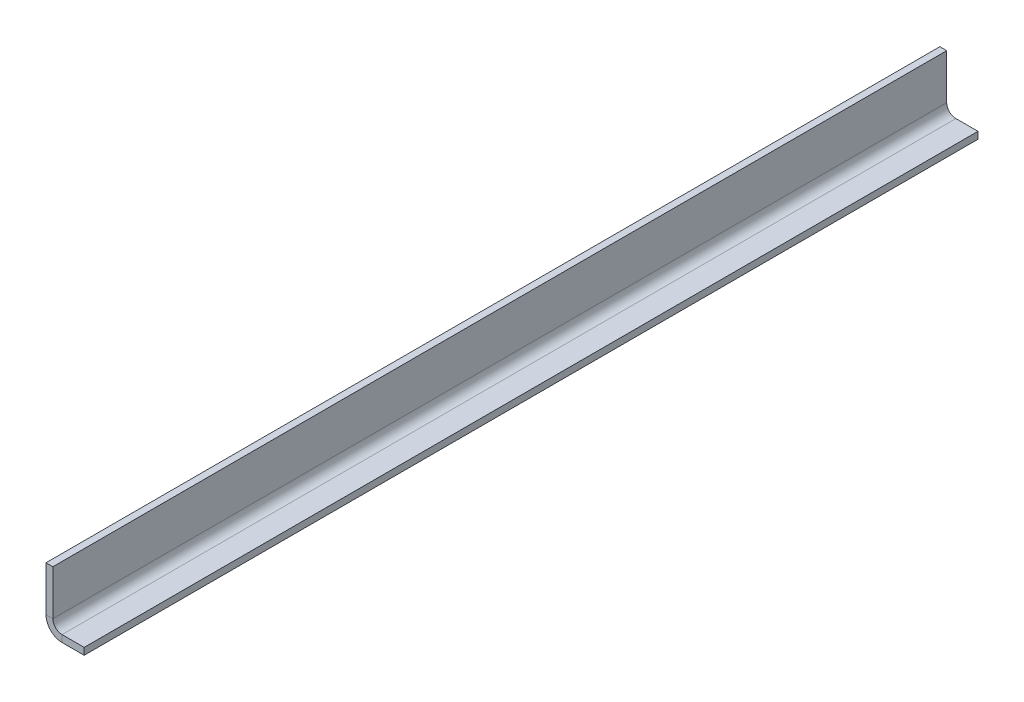
ISO-10303-21;
HEADER;
FILE_DESCRIPTION(('STEP AP214'),'2;1');
FILE_NAME('part.step','',(''),(''),'','','');
FILE_SCHEMA(('AUTOMOTIVE_DESIGN { 1 0 10303 214 1 1 1 1 }'));
ENDSEC;
DATA;
#1=APPLICATION_CONTEXT('core data for automotive mechanical design processes');
#2=APPLICATION_PROTOCOL_DEFINITION('international standard','automotive_design',2000,#1);
#3=PRODUCT_CONTEXT('',#1,'mechanical');
#4=PRODUCT('Part','Part','',(#3));
#5=PRODUCT_RELATED_PRODUCT_CATEGORY('part','',(#4));
#6=PRODUCT_DEFINITION_FORMATION('','',#4);
#7=PRODUCT_DEFINITION_CONTEXT('part definition',#1,'design');
#8=PRODUCT_DEFINITION('design','',#6,#7);
#9=PRODUCT_DEFINITION_SHAPE('','',#8);
#10=(LENGTH_UNIT() NAMED_UNIT(*) SI_UNIT(.MILLI.,.METRE.));
#11=(NAMED_UNIT(*) PLANE_ANGLE_UNIT() SI_UNIT($,.RADIAN.));
#12=(NAMED_UNIT(*) SI_UNIT($,.STERADIAN.) SOLID_ANGLE_UNIT());
#13=UNCERTAINTY_MEASURE_WITH_UNIT(LENGTH_MEASURE(1.E-05),#10,'distance_accuracy_value','');
#14=(GEOMETRIC_REPRESENTATION_CONTEXT(3) GLOBAL_UNCERTAINTY_ASSIGNED_CONTEXT((#13)) GLOBAL_UNIT_ASSIGNED_CONTEXT((#10,
#11,#12)) REPRESENTATION_CONTEXT('',''));
#15=CARTESIAN_POINT('',(0.,0.,0.));
#16=DIRECTION('',(0.,0.,1.));
#17=DIRECTION('',(1.,0.,0.));
#18=AXIS2_PLACEMENT_3D('',#15,#16,#17);
#19=CARTESIAN_POINT('',(3.175,3.175,0.));
#20=DIRECTION('',(0.,0.,1.));
#21=DIRECTION('',(0.,1.,0.));
#22=AXIS2_PLACEMENT_3D('',#19,#20,#21);
#23=PLANE('',#22);
#24=DIRECTION('',(1.,0.,0.));
#25=VECTOR('',#24,1.);
#26=CARTESIAN_POINT('',(3.175,5.175,0.));
#27=LINE('',#26,#25);
#28=CARTESIAN_POINT('',(1.675,5.175,0.));
#29=VERTEX_POINT('',#28);
#30=CARTESIAN_POINT('',(3.175,5.175,0.));
#31=VERTEX_POINT('',#30);
#32=EDGE_CURVE('E11',#29,#31,#27,.T.);
#33=ORIENTED_EDGE('',*,*,#32,.F.);
#34=DIRECTION('',(0.,1.,0.));
#35=VECTOR('',#34,1.);
#36=CARTESIAN_POINT('',(1.675,3.175,0.));
#37=LINE('',#36,#35);
#38=CARTESIAN_POINT('',(1.675,15.,0.));
#39=VERTEX_POINT('',#38);
#40=EDGE_CURVE('E95',#29,#39,#37,.T.);
#41=ORIENTED_EDGE('',*,*,#40,.T.);
#42=DIRECTION('',(1.,0.,0.));
#43=VECTOR('',#42,1.);
#44=CARTESIAN_POINT('',(3.175,15.,0.));
#45=LINE('',#44,#43);
#46=CARTESIAN_POINT('',(3.175,15.,0.));
#47=VERTEX_POINT('',#46);
#48=EDGE_CURVE('E55',#39,#47,#45,.T.);
#49=ORIENTED_EDGE('',*,*,#48,.T.);
#50=DIRECTION('',(0.,1.,0.));
#51=VECTOR('',#50,1.);
#52=CARTESIAN_POINT('',(3.175,3.175,0.));
#53=LINE('',#52,#51);
#54=EDGE_CURVE('E98',#31,#47,#53,.T.);
#55=ORIENTED_EDGE('',*,*,#54,.F.);
#56=EDGE_LOOP('',(#33,#41,#49,#55));
#57=FACE_BOUND('',#56,.T.);
#58=ADVANCED_FACE('F45',(#57),#23,.F.);
#59=CARTESIAN_POINT('',(3.175,15.,195.));
#60=DIRECTION('',(0.,1.,0.));
#61=DIRECTION('',(0.,0.,-1.));
#62=AXIS2_PLACEMENT_3D('',#59,#60,#61);
#63=PLANE('',#62);
#64=ORIENTED_EDGE('',*,*,#48,.F.);
#65=DIRECTION('',(0.,0.,1.));
#66=VECTOR('',#65,1.);
#67=CARTESIAN_POINT('',(1.675,15.,195.));
#68=LINE('',#67,#66);
#69=CARTESIAN_POINT('',(1.675,15.,195.));
#70=VERTEX_POINT('',#69);
#71=EDGE_CURVE('E123',#70,#39,#68,.F.);
#72=ORIENTED_EDGE('',*,*,#71,.F.);
#73=DIRECTION('',(1.,0.,0.));
#74=VECTOR('',#73,1.);
#75=CARTESIAN_POINT('',(3.175,15.,195.));
#76=LINE('',#75,#74);
#77=CARTESIAN_POINT('',(3.175,15.,195.));
#78=VERTEX_POINT('',#77);
#79=EDGE_CURVE('E141',#70,#78,#76,.T.);
#80=ORIENTED_EDGE('',*,*,#79,.T.);
#81=DIRECTION('',(0.,0.,-1.));
#82=VECTOR('',#81,1.);
#83=CARTESIAN_POINT('',(3.175,15.,195.));
#84=LINE('',#83,#82);
#85=EDGE_CURVE('E152',#78,#47,#84,.T.);
#86=ORIENTED_EDGE('',*,*,#85,.T.);
#87=EDGE_LOOP('',(#64,#72,#80,#86));
#88=FACE_BOUND('',#87,.T.);
#89=ADVANCED_FACE('F158',(#88),#63,.T.);
#90=CARTESIAN_POINT('',(3.175,3.175,195.));
#91=DIRECTION('',(0.,0.,1.));
#92=DIRECTION('',(0.,1.,0.));
#93=AXIS2_PLACEMENT_3D('',#90,#91,#92);
#94=PLANE('',#93);
#95=ORIENTED_EDGE('',*,*,#79,.F.);
#96=DIRECTION('',(0.,1.,0.));
#97=VECTOR('',#96,1.);
#98=CARTESIAN_POINT('',(1.675,3.175,195.));
#99=LINE('',#98,#97);
#100=CARTESIAN_POINT('',(1.675,5.175,195.));
#101=VERTEX_POINT('',#100);
#102=EDGE_CURVE('E183',#101,#70,#99,.T.);
#103=ORIENTED_EDGE('',*,*,#102,.F.);
#104=DIRECTION('',(1.,0.,0.));
#105=VECTOR('',#104,1.);
#106=CARTESIAN_POINT('',(3.175,5.175,195.));
#107=LINE('',#106,#105);
#108=CARTESIAN_POINT('',(3.175,5.175,195.));
#109=VERTEX_POINT('',#108);
#110=EDGE_CURVE('E138',#101,#109,#107,.T.);
#111=ORIENTED_EDGE('',*,*,#110,.T.);
#112=DIRECTION('',(0.,1.,0.));
#113=VECTOR('',#112,1.);
#114=CARTESIAN_POINT('',(3.175,3.175,195.));
#115=LINE('',#114,#113);
#116=EDGE_CURVE('E159',#109,#78,#115,.T.);
#117=ORIENTED_EDGE('',*,*,#116,.T.);
#118=EDGE_LOOP('',(#95,#103,#111,#117));
#119=FACE_BOUND('',#118,.T.);
#120=ADVANCED_FACE('F189',(#119),#94,.T.);
#121=CARTESIAN_POINT('',(5.175,5.175,195.));
#122=DIRECTION('',(0.,0.,1.));
#123=DIRECTION('',(1.,0.,0.));
#124=AXIS2_PLACEMENT_3D('',#121,#122,#123);
#125=PLANE('',#124);
#126=ORIENTED_EDGE('',*,*,#110,.F.);
#127=CARTESIAN_POINT('',(5.175,5.175,195.));
#128=DIRECTION('',(0.,0.,1.));
#129=DIRECTION('',(1.,0.,0.));
#130=AXIS2_PLACEMENT_3D('',#127,#128,#129);
#131=CIRCLE('',#130,3.5);
#132=CARTESIAN_POINT('',(5.175,1.675,195.));
#133=VERTEX_POINT('',#132);
#134=EDGE_CURVE('E113',#101,#133,#131,.T.);
#135=ORIENTED_EDGE('',*,*,#134,.T.);
#136=DIRECTION('',(0.,1.,0.));
#137=VECTOR('',#136,1.);
#138=CARTESIAN_POINT('',(5.175,3.175,195.));
#139=LINE('',#138,#137);
#140=CARTESIAN_POINT('',(5.175,3.175,195.));
#141=VERTEX_POINT('',#140);
#142=EDGE_CURVE('E63',#133,#141,#139,.T.);
#143=ORIENTED_EDGE('',*,*,#142,.T.);
#144=CARTESIAN_POINT('',(5.175,5.175,195.));
#145=DIRECTION('',(0.,0.,-1.));
#146=DIRECTION('',(-1.,0.,0.));
#147=AXIS2_PLACEMENT_3D('',#144,#145,#146);
#148=CIRCLE('',#147,2.);
#149=EDGE_CURVE('E156',#109,#141,#148,.F.);
#150=ORIENTED_EDGE('',*,*,#149,.F.);
#151=EDGE_LOOP('',(#126,#135,#143,#150));
#152=FACE_BOUND('',#151,.T.);
#153=ADVANCED_FACE('F192',(#152),#125,.T.);
#154=CARTESIAN_POINT('',(10.,3.175,195.));
#155=DIRECTION('',(0.,0.,1.));
#156=DIRECTION('',(-1.,0.,0.));
#157=AXIS2_PLACEMENT_3D('',#154,#155,#156);
#158=PLANE('',#157);
#159=ORIENTED_EDGE('',*,*,#142,.F.);
#160=DIRECTION('',(1.,0.,0.));
#161=VECTOR('',#160,1.);
#162=CARTESIAN_POINT('',(10.,1.675,195.));
#163=LINE('',#162,#161);
#164=CARTESIAN_POINT('',(10.,1.675,195.));
#165=VERTEX_POINT('',#164);
#166=EDGE_CURVE('E182',#165,#133,#163,.F.);
#167=ORIENTED_EDGE('',*,*,#166,.F.);
#168=DIRECTION('',(0.,1.,0.));
#169=VECTOR('',#168,1.);
#170=CARTESIAN_POINT('',(10.,3.175,195.));
#171=LINE('',#170,#169);
#172=CARTESIAN_POINT('',(10.,3.175,195.));
#173=VERTEX_POINT('',#172);
#174=EDGE_CURVE('E134',#165,#173,#171,.T.);
#175=ORIENTED_EDGE('',*,*,#174,.T.);
#176=DIRECTION('',(-1.,0.,0.));
#177=VECTOR('',#176,1.);
#178=CARTESIAN_POINT('',(10.,3.175,195.));
#179=LINE('',#178,#177);
#180=EDGE_CURVE('E166',#173,#141,#179,.T.);
#181=ORIENTED_EDGE('',*,*,#180,.T.);
#182=EDGE_LOOP('',(#159,#167,#175,#181));
#183=FACE_BOUND('',#182,.T.);
#184=ADVANCED_FACE('F203',(#183),#158,.T.);
#185=CARTESIAN_POINT('',(10.,3.175,195.));
#186=DIRECTION('',(-1.,0.,0.));
#187=DIRECTION('',(0.,0.,-1.));
#188=AXIS2_PLACEMENT_3D('',#185,#186,#187);
#189=PLANE('',#188);
#190=ORIENTED_EDGE('',*,*,#174,.F.);
#191=DIRECTION('',(0.,0.,1.));
#192=VECTOR('',#191,1.);
#193=CARTESIAN_POINT('',(10.,1.675,195.));
#194=LINE('',#193,#192);
#195=CARTESIAN_POINT('',(10.,1.675,0.));
#196=VERTEX_POINT('',#195);
#197=EDGE_CURVE('E118',#165,#196,#194,.F.);
#198=ORIENTED_EDGE('',*,*,#197,.T.);
#199=DIRECTION('',(0.,1.,0.));
#200=VECTOR('',#199,1.);
#201=CARTESIAN_POINT('',(10.,3.175,0.));
#202=LINE('',#201,#200);
#203=CARTESIAN_POINT('',(10.,3.175,0.));
#204=VERTEX_POINT('',#203);
#205=EDGE_CURVE('E131',#196,#204,#202,.T.);
#206=ORIENTED_EDGE('',*,*,#205,.T.);
#207=DIRECTION('',(0.,0.,-1.));
#208=VECTOR('',#207,1.);
#209=CARTESIAN_POINT('',(10.,3.175,195.));
#210=LINE('',#209,#208);
#211=EDGE_CURVE('E169',#173,#204,#210,.T.);
#212=ORIENTED_EDGE('',*,*,#211,.F.);
#213=EDGE_LOOP('',(#190,#198,#206,#212));
#214=FACE_BOUND('',#213,.T.);
#215=ADVANCED_FACE('F209',(#214),#189,.F.);
#216=CARTESIAN_POINT('',(10.,3.175,0.));
#217=DIRECTION('',(0.,0.,1.));
#218=DIRECTION('',(-1.,0.,0.));
#219=AXIS2_PLACEMENT_3D('',#216,#217,#218);
#220=PLANE('',#219);
#221=ORIENTED_EDGE('',*,*,#205,.F.);
#222=DIRECTION('',(1.,0.,0.));
#223=VECTOR('',#222,1.);
#224=CARTESIAN_POINT('',(10.,1.675,0.));
#225=LINE('',#224,#223);
#226=CARTESIAN_POINT('',(5.175,1.675,0.));
#227=VERTEX_POINT('',#226);
#228=EDGE_CURVE('E180',#196,#227,#225,.F.);
#229=ORIENTED_EDGE('',*,*,#228,.T.);
#230=DIRECTION('',(0.,1.,0.));
#231=VECTOR('',#230,1.);
#232=CARTESIAN_POINT('',(5.175,3.175,0.));
#233=LINE('',#232,#231);
#234=CARTESIAN_POINT('',(5.175,3.175,0.));
#235=VERTEX_POINT('',#234);
#236=EDGE_CURVE('E49',#227,#235,#233,.T.);
#237=ORIENTED_EDGE('',*,*,#236,.T.);
#238=DIRECTION('',(-1.,0.,0.));
#239=VECTOR('',#238,1.);
#240=CARTESIAN_POINT('',(10.,3.175,0.));
#241=LINE('',#240,#239);
#242=EDGE_CURVE('E161',#204,#235,#241,.T.);
#243=ORIENTED_EDGE('',*,*,#242,.F.);
#244=EDGE_LOOP('',(#221,#229,#237,#243));
#245=FACE_BOUND('',#244,.T.);
#246=ADVANCED_FACE('F213',(#245),#220,.F.);
#247=CARTESIAN_POINT('',(5.175,5.175,0.));
#248=DIRECTION('',(0.,0.,-1.));
#249=DIRECTION('',(-1.,0.,0.));
#250=AXIS2_PLACEMENT_3D('',#247,#248,#249);
#251=PLANE('',#250);
#252=CARTESIAN_POINT('',(5.175,5.175,0.));
#253=DIRECTION('',(0.,0.,1.));
#254=DIRECTION('',(1.,0.,0.));
#255=AXIS2_PLACEMENT_3D('',#252,#253,#254);
#256=CIRCLE('',#255,3.5);
#257=EDGE_CURVE('E111',#227,#29,#256,.F.);
#258=ORIENTED_EDGE('',*,*,#257,.T.);
#259=ORIENTED_EDGE('',*,*,#32,.T.);
#260=CARTESIAN_POINT('',(5.175,5.175,0.));
#261=DIRECTION('',(0.,0.,1.));
#262=DIRECTION('',(1.,0.,0.));
#263=AXIS2_PLACEMENT_3D('',#260,#261,#262);
#264=CIRCLE('',#263,2.);
#265=EDGE_CURVE('E176',#235,#31,#264,.F.);
#266=ORIENTED_EDGE('',*,*,#265,.F.);
#267=ORIENTED_EDGE('',*,*,#236,.F.);
#268=EDGE_LOOP('',(#258,#259,#266,#267));
#269=FACE_BOUND('',#268,.T.);
#270=ADVANCED_FACE('F47',(#269),#251,.T.);
#271=CARTESIAN_POINT('',(10.,3.175,195.));
#272=DIRECTION('',(0.,-1.,0.));
#273=DIRECTION('',(1.,0.,0.));
#274=AXIS2_PLACEMENT_3D('',#271,#272,#273);
#275=PLANE('',#274);
#276=ORIENTED_EDGE('',*,*,#242,.T.);
#277=DIRECTION('',(0.,0.,-1.));
#278=VECTOR('',#277,1.);
#279=CARTESIAN_POINT('',(5.175,3.175,195.));
#280=LINE('',#279,#278);
#281=EDGE_CURVE('E173',#235,#141,#280,.F.);
#282=ORIENTED_EDGE('',*,*,#281,.T.);
#283=ORIENTED_EDGE('',*,*,#180,.F.);
#284=ORIENTED_EDGE('',*,*,#211,.T.);
#285=EDGE_LOOP('',(#276,#282,#283,#284));
#286=FACE_BOUND('',#285,.T.);
#287=ADVANCED_FACE('F208',(#286),#275,.F.);
#288=CARTESIAN_POINT('',(3.175,3.175,195.));
#289=DIRECTION('',(-1.,0.,0.));
#290=DIRECTION('',(0.,0.,1.));
#291=AXIS2_PLACEMENT_3D('',#288,#289,#290);
#292=PLANE('',#291);
#293=ORIENTED_EDGE('',*,*,#116,.F.);
#294=DIRECTION('',(0.,0.,-1.));
#295=VECTOR('',#294,1.);
#296=CARTESIAN_POINT('',(3.175,5.175,0.));
#297=LINE('',#296,#295);
#298=EDGE_CURVE('E155',#109,#31,#297,.T.);
#299=ORIENTED_EDGE('',*,*,#298,.T.);
#300=ORIENTED_EDGE('',*,*,#54,.T.);
#301=ORIENTED_EDGE('',*,*,#85,.F.);
#302=EDGE_LOOP('',(#293,#299,#300,#301));
#303=FACE_BOUND('',#302,.T.);
#304=ADVANCED_FACE('F151',(#303),#292,.F.);
#305=CARTESIAN_POINT('',(5.175,5.175,195.));
#306=DIRECTION('',(0.,0.,1.));
#307=DIRECTION('',(1.,0.,0.));
#308=AXIS2_PLACEMENT_3D('',#305,#306,#307);
#309=CYLINDRICAL_SURFACE('',#308,2.);
#310=ORIENTED_EDGE('',*,*,#149,.T.);
#311=ORIENTED_EDGE('',*,*,#281,.F.);
#312=ORIENTED_EDGE('',*,*,#265,.T.);
#313=ORIENTED_EDGE('',*,*,#298,.F.);
#314=EDGE_LOOP('',(#310,#311,#312,#313));
#315=FACE_BOUND('',#314,.T.);
#316=ADVANCED_FACE('F195',(#315),#309,.F.);
#317=CARTESIAN_POINT('',(10.,1.675,195.));
#318=DIRECTION('',(0.,-1.,0.));
#319=DIRECTION('',(1.,0.,0.));
#320=AXIS2_PLACEMENT_3D('',#317,#318,#319);
#321=PLANE('',#320);
#322=ORIENTED_EDGE('',*,*,#228,.F.);
#323=ORIENTED_EDGE('',*,*,#197,.F.);
#324=ORIENTED_EDGE('',*,*,#166,.T.);
#325=DIRECTION('',(0.,0.,1.));
#326=VECTOR('',#325,1.);
#327=CARTESIAN_POINT('',(5.175,1.675,195.));
#328=LINE('',#327,#326);
#329=EDGE_CURVE('E117',#227,#133,#328,.T.);
#330=ORIENTED_EDGE('',*,*,#329,.F.);
#331=EDGE_LOOP('',(#322,#323,#324,#330));
#332=FACE_BOUND('',#331,.T.);
#333=ADVANCED_FACE('F215',(#332),#321,.T.);
#334=CARTESIAN_POINT('',(1.675,3.175,195.));
#335=DIRECTION('',(-1.,0.,0.));
#336=DIRECTION('',(0.,0.,1.));
#337=AXIS2_PLACEMENT_3D('',#334,#335,#336);
#338=PLANE('',#337);
#339=ORIENTED_EDGE('',*,*,#102,.T.);
#340=ORIENTED_EDGE('',*,*,#71,.T.);
#341=ORIENTED_EDGE('',*,*,#40,.F.);
#342=DIRECTION('',(0.,0.,1.));
#343=VECTOR('',#342,1.);
#344=CARTESIAN_POINT('',(1.675,5.175,195.));
#345=LINE('',#344,#343);
#346=EDGE_CURVE('E108',#101,#29,#345,.F.);
#347=ORIENTED_EDGE('',*,*,#346,.F.);
#348=EDGE_LOOP('',(#339,#340,#341,#347));
#349=FACE_BOUND('',#348,.T.);
#350=ADVANCED_FACE('F121',(#349),#338,.T.);
#351=CARTESIAN_POINT('',(5.175,5.175,195.));
#352=DIRECTION('',(0.,0.,1.));
#353=DIRECTION('',(1.,0.,0.));
#354=AXIS2_PLACEMENT_3D('',#351,#352,#353);
#355=CYLINDRICAL_SURFACE('',#354,3.5);
#356=ORIENTED_EDGE('',*,*,#134,.F.);
#357=ORIENTED_EDGE('',*,*,#346,.T.);
#358=ORIENTED_EDGE('',*,*,#257,.F.);
#359=ORIENTED_EDGE('',*,*,#329,.T.);
#360=EDGE_LOOP('',(#356,#357,#358,#359));
#361=FACE_BOUND('',#360,.T.);
#362=ADVANCED_FACE('F109',(#361),#355,.T.);
#363=CLOSED_SHELL('',(#58,#89,#120,#153,#184,#215,#246,#270,#287,#304,#316,#333,#350,#362));
#364=MANIFOLD_SOLID_BREP('B2',#363);
#365=ADVANCED_BREP_SHAPE_REPRESENTATION('',(#18,#364),#14);
#366=SHAPE_DEFINITION_REPRESENTATION(#9,#365);
ENDSEC;
END-ISO-10303-21;
